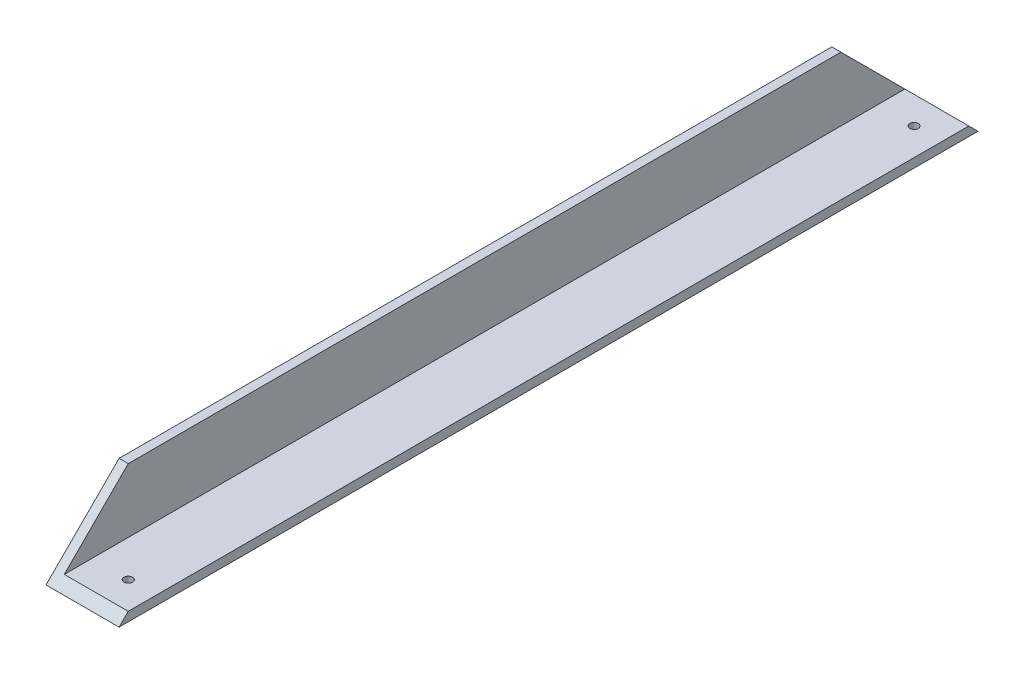
ISO-10303-21;
HEADER;
FILE_DESCRIPTION(('STEP AP214'),'2;1');
FILE_NAME('part.step','',(''),(''),'','','');
FILE_SCHEMA(('AUTOMOTIVE_DESIGN { 1 0 10303 214 1 1 1 1 }'));
ENDSEC;
DATA;
#1=APPLICATION_CONTEXT('core data for automotive mechanical design processes');
#2=APPLICATION_PROTOCOL_DEFINITION('international standard','automotive_design',2000,#1);
#3=PRODUCT_CONTEXT('',#1,'mechanical');
#4=PRODUCT('Part','Part','',(#3));
#5=PRODUCT_RELATED_PRODUCT_CATEGORY('part','',(#4));
#6=PRODUCT_DEFINITION_FORMATION('','',#4);
#7=PRODUCT_DEFINITION_CONTEXT('part definition',#1,'design');
#8=PRODUCT_DEFINITION('design','',#6,#7);
#9=PRODUCT_DEFINITION_SHAPE('','',#8);
#10=(LENGTH_UNIT() NAMED_UNIT(*) SI_UNIT(.MILLI.,.METRE.));
#11=(NAMED_UNIT(*) PLANE_ANGLE_UNIT() SI_UNIT($,.RADIAN.));
#12=(NAMED_UNIT(*) SI_UNIT($,.STERADIAN.) SOLID_ANGLE_UNIT());
#13=UNCERTAINTY_MEASURE_WITH_UNIT(LENGTH_MEASURE(1.E-05),#10,'distance_accuracy_value','');
#14=(GEOMETRIC_REPRESENTATION_CONTEXT(3) GLOBAL_UNCERTAINTY_ASSIGNED_CONTEXT((#13)) GLOBAL_UNIT_ASSIGNED_CONTEXT((#10,
#11,#12)) REPRESENTATION_CONTEXT('',''));
#15=CARTESIAN_POINT('',(0.,0.,0.));
#16=DIRECTION('',(0.,0.,1.));
#17=DIRECTION('',(1.,0.,0.));
#18=AXIS2_PLACEMENT_3D('',#15,#16,#17);
#19=CARTESIAN_POINT('',(25.4,0.,298.45));
#20=DIRECTION('',(-1.,0.,0.));
#21=DIRECTION('',(0.,0.,1.));
#22=AXIS2_PLACEMENT_3D('',#19,#20,#21);
#23=PLANE('',#22);
#24=DIRECTION('',(0.,0.707106781186544,-0.707106781186551));
#25=VECTOR('',#24,1.);
#26=CARTESIAN_POINT('',(25.4,0.,298.45));
#27=LINE('',#26,#25);
#28=CARTESIAN_POINT('',(25.4,0.,298.45));
#29=VERTEX_POINT('',#28);
#30=CARTESIAN_POINT('',(25.4,3.17500000000001,295.275));
#31=VERTEX_POINT('',#30);
#32=EDGE_CURVE('E145',#29,#31,#27,.T.);
#33=ORIENTED_EDGE('',*,*,#32,.F.);
#34=DIRECTION('',(0.,0.,-1.));
#35=VECTOR('',#34,1.);
#36=CARTESIAN_POINT('',(25.4,0.,298.45));
#37=LINE('',#36,#35);
#38=CARTESIAN_POINT('',(25.4,0.,0.));
#39=VERTEX_POINT('',#38);
#40=EDGE_CURVE('E11',#29,#39,#37,.T.);
#41=ORIENTED_EDGE('',*,*,#40,.T.);
#42=DIRECTION('',(0.,0.707106781186547,0.707106781186548));
#43=VECTOR('',#42,1.);
#44=CARTESIAN_POINT('',(25.4,149.225,149.225));
#45=LINE('',#44,#43);
#46=CARTESIAN_POINT('',(25.4,3.17500000000001,3.17500000000004));
#47=VERTEX_POINT('',#46);
#48=EDGE_CURVE('E135',#39,#47,#45,.T.);
#49=ORIENTED_EDGE('',*,*,#48,.T.);
#50=DIRECTION('',(0.,0.,-1.));
#51=VECTOR('',#50,1.);
#52=CARTESIAN_POINT('',(25.4,3.17500000000001,298.45));
#53=LINE('',#52,#51);
#54=EDGE_CURVE('E52',#31,#47,#53,.T.);
#55=ORIENTED_EDGE('',*,*,#54,.F.);
#56=EDGE_LOOP('',(#33,#41,#49,#55));
#57=FACE_BOUND('',#56,.T.);
#58=ADVANCED_FACE('F43',(#57),#23,.F.);
#59=CARTESIAN_POINT('',(25.4,3.17500000000001,298.45));
#60=DIRECTION('',(0.,-1.,0.));
#61=DIRECTION('',(1.,0.,0.));
#62=AXIS2_PLACEMENT_3D('',#59,#60,#61);
#63=PLANE('',#62);
#64=CARTESIAN_POINT('',(15.875,3.17500000000004,12.7000000000001));
#65=DIRECTION('',(0.,-1.,0.));
#66=DIRECTION('',(1.,0.,0.));
#67=AXIS2_PLACEMENT_3D('',#64,#65,#66);
#68=CIRCLE('',#67,1.5);
#69=CARTESIAN_POINT('',(17.375,3.17500000000004,12.7000000000001));
#70=VERTEX_POINT('',#69);
#71=EDGE_CURVE('E161',#70,#70,#68,.T.);
#72=ORIENTED_EDGE('',*,*,#71,.T.);
#73=EDGE_LOOP('',(#72));
#74=FACE_BOUND('',#73,.T.);
#75=CARTESIAN_POINT('',(15.875,3.17500000000004,285.75));
#76=DIRECTION('',(0.,-1.,0.));
#77=DIRECTION('',(1.,0.,0.));
#78=AXIS2_PLACEMENT_3D('',#75,#76,#77);
#79=CIRCLE('',#78,1.5);
#80=CARTESIAN_POINT('',(17.375,3.17500000000004,285.75));
#81=VERTEX_POINT('',#80);
#82=EDGE_CURVE('E106',#81,#81,#79,.T.);
#83=ORIENTED_EDGE('',*,*,#82,.T.);
#84=EDGE_LOOP('',(#83));
#85=FACE_BOUND('',#84,.T.);
#86=DIRECTION('',(-1.,0.,0.));
#87=VECTOR('',#86,1.);
#88=CARTESIAN_POINT('',(25.4,3.17500000000001,295.275));
#89=LINE('',#88,#87);
#90=CARTESIAN_POINT('',(3.175,3.175,295.275));
#91=VERTEX_POINT('',#90);
#92=EDGE_CURVE('E128',#31,#91,#89,.T.);
#93=ORIENTED_EDGE('',*,*,#92,.F.);
#94=ORIENTED_EDGE('',*,*,#54,.T.);
#95=DIRECTION('',(-1.,0.,0.));
#96=VECTOR('',#95,1.);
#97=CARTESIAN_POINT('',(25.4,3.17500000000001,3.17500000000004));
#98=LINE('',#97,#96);
#99=CARTESIAN_POINT('',(3.175,3.17500000000001,3.17499999999993));
#100=VERTEX_POINT('',#99);
#101=EDGE_CURVE('E127',#47,#100,#98,.T.);
#102=ORIENTED_EDGE('',*,*,#101,.T.);
#103=DIRECTION('',(0.,0.,-1.));
#104=VECTOR('',#103,1.);
#105=CARTESIAN_POINT('',(3.175,3.175,298.45));
#106=LINE('',#105,#104);
#107=EDGE_CURVE('E114',#91,#100,#106,.T.);
#108=ORIENTED_EDGE('',*,*,#107,.F.);
#109=EDGE_LOOP('',(#93,#94,#102,#108));
#110=FACE_BOUND('',#109,.T.);
#111=ADVANCED_FACE('F125',(#74,#85,#110),#63,.F.);
#112=CARTESIAN_POINT('',(3.175,3.175,298.45));
#113=DIRECTION('',(-1.,0.,0.));
#114=DIRECTION('',(0.,-1.,0.));
#115=AXIS2_PLACEMENT_3D('',#112,#113,#114);
#116=PLANE('',#115);
#117=DIRECTION('',(0.,0.707106781186544,-0.707106781186551));
#118=VECTOR('',#117,1.);
#119=CARTESIAN_POINT('',(3.175,1.58749999999994,296.8625));
#120=LINE('',#119,#118);
#121=CARTESIAN_POINT('',(3.17500000000004,25.4,273.05));
#122=VERTEX_POINT('',#121);
#123=EDGE_CURVE('E93',#91,#122,#120,.T.);
#124=ORIENTED_EDGE('',*,*,#123,.F.);
#125=ORIENTED_EDGE('',*,*,#107,.T.);
#126=DIRECTION('',(0.,0.707106781186547,0.707106781186548));
#127=VECTOR('',#126,1.);
#128=CARTESIAN_POINT('',(3.17499999999999,150.8125,150.8125));
#129=LINE('',#128,#127);
#130=CARTESIAN_POINT('',(3.17500000000004,25.4,25.4));
#131=VERTEX_POINT('',#130);
#132=EDGE_CURVE('E137',#100,#131,#129,.T.);
#133=ORIENTED_EDGE('',*,*,#132,.T.);
#134=DIRECTION('',(0.,0.,-1.));
#135=VECTOR('',#134,1.);
#136=CARTESIAN_POINT('',(3.175,25.4,298.45));
#137=LINE('',#136,#135);
#138=EDGE_CURVE('E112',#122,#131,#137,.T.);
#139=ORIENTED_EDGE('',*,*,#138,.F.);
#140=EDGE_LOOP('',(#124,#125,#133,#139));
#141=FACE_BOUND('',#140,.T.);
#142=ADVANCED_FACE('F153',(#141),#116,.F.);
#143=CARTESIAN_POINT('',(3.175,25.4,298.45));
#144=DIRECTION('',(0.,-1.,0.));
#145=DIRECTION('',(0.,0.,-1.));
#146=AXIS2_PLACEMENT_3D('',#143,#144,#145);
#147=PLANE('',#146);
#148=DIRECTION('',(-1.,0.,0.));
#149=VECTOR('',#148,1.);
#150=CARTESIAN_POINT('',(711.2,25.4,273.05));
#151=LINE('',#150,#149);
#152=CARTESIAN_POINT('',(0.,25.4,273.05));
#153=VERTEX_POINT('',#152);
#154=EDGE_CURVE('E90',#122,#153,#151,.T.);
#155=ORIENTED_EDGE('',*,*,#154,.F.);
#156=ORIENTED_EDGE('',*,*,#138,.T.);
#157=DIRECTION('',(-1.,0.,0.));
#158=VECTOR('',#157,1.);
#159=CARTESIAN_POINT('',(711.2,25.4,25.4));
#160=LINE('',#159,#158);
#161=CARTESIAN_POINT('',(0.,25.4,25.4));
#162=VERTEX_POINT('',#161);
#163=EDGE_CURVE('E111',#131,#162,#160,.T.);
#164=ORIENTED_EDGE('',*,*,#163,.T.);
#165=DIRECTION('',(0.,0.,-1.));
#166=VECTOR('',#165,1.);
#167=CARTESIAN_POINT('',(0.,25.4,298.45));
#168=LINE('',#167,#166);
#169=EDGE_CURVE('E101',#153,#162,#168,.T.);
#170=ORIENTED_EDGE('',*,*,#169,.F.);
#171=EDGE_LOOP('',(#155,#156,#164,#170));
#172=FACE_BOUND('',#171,.T.);
#173=ADVANCED_FACE('F109',(#172),#147,.F.);
#174=CARTESIAN_POINT('',(0.,25.4,298.45));
#175=DIRECTION('',(1.,0.,0.));
#176=DIRECTION('',(0.,0.,-1.));
#177=AXIS2_PLACEMENT_3D('',#174,#175,#176);
#178=PLANE('',#177);
#179=DIRECTION('',(0.,0.707106781186544,-0.707106781186551));
#180=VECTOR('',#179,1.);
#181=CARTESIAN_POINT('',(0.,149.225,149.224999999998));
#182=LINE('',#181,#180);
#183=CARTESIAN_POINT('',(0.,0.,298.45));
#184=VERTEX_POINT('',#183);
#185=EDGE_CURVE('E58',#184,#153,#182,.T.);
#186=ORIENTED_EDGE('',*,*,#185,.T.);
#187=ORIENTED_EDGE('',*,*,#169,.T.);
#188=DIRECTION('',(0.,0.707106781186547,0.707106781186548));
#189=VECTOR('',#188,1.);
#190=CARTESIAN_POINT('',(0.,0.,0.));
#191=LINE('',#190,#189);
#192=CARTESIAN_POINT('',(0.,0.,0.));
#193=VERTEX_POINT('',#192);
#194=EDGE_CURVE('E147',#193,#162,#191,.T.);
#195=ORIENTED_EDGE('',*,*,#194,.F.);
#196=DIRECTION('',(0.,0.,-1.));
#197=VECTOR('',#196,1.);
#198=CARTESIAN_POINT('',(0.,0.,298.45));
#199=LINE('',#198,#197);
#200=EDGE_CURVE('E104',#184,#193,#199,.T.);
#201=ORIENTED_EDGE('',*,*,#200,.F.);
#202=EDGE_LOOP('',(#186,#187,#195,#201));
#203=FACE_BOUND('',#202,.T.);
#204=ADVANCED_FACE('F99',(#203),#178,.F.);
#205=CARTESIAN_POINT('',(0.,0.,298.45));
#206=DIRECTION('',(0.,1.,0.));
#207=DIRECTION('',(0.,0.,1.));
#208=AXIS2_PLACEMENT_3D('',#205,#206,#207);
#209=PLANE('',#208);
#210=CARTESIAN_POINT('',(15.875,0.,12.7000000000001));
#211=DIRECTION('',(0.,-1.,0.));
#212=DIRECTION('',(0.,0.,-1.));
#213=AXIS2_PLACEMENT_3D('',#210,#211,#212);
#214=CIRCLE('',#213,1.5);
#215=CARTESIAN_POINT('',(15.875,0.,11.2000000000001));
#216=VERTEX_POINT('',#215);
#217=EDGE_CURVE('E164',#216,#216,#214,.T.);
#218=ORIENTED_EDGE('',*,*,#217,.F.);
#219=EDGE_LOOP('',(#218));
#220=FACE_BOUND('',#219,.T.);
#221=CARTESIAN_POINT('',(15.875,0.,285.75));
#222=DIRECTION('',(0.,-1.,0.));
#223=DIRECTION('',(0.,0.,-1.));
#224=AXIS2_PLACEMENT_3D('',#221,#222,#223);
#225=CIRCLE('',#224,1.5);
#226=CARTESIAN_POINT('',(15.875,0.,284.25));
#227=VERTEX_POINT('',#226);
#228=EDGE_CURVE('E158',#227,#227,#225,.T.);
#229=ORIENTED_EDGE('',*,*,#228,.F.);
#230=EDGE_LOOP('',(#229));
#231=FACE_BOUND('',#230,.T.);
#232=DIRECTION('',(1.,0.,0.));
#233=VECTOR('',#232,1.);
#234=CARTESIAN_POINT('',(0.,0.,0.));
#235=LINE('',#234,#233);
#236=EDGE_CURVE('E141',#193,#39,#235,.T.);
#237=ORIENTED_EDGE('',*,*,#236,.T.);
#238=ORIENTED_EDGE('',*,*,#40,.F.);
#239=DIRECTION('',(1.,0.,0.));
#240=VECTOR('',#239,1.);
#241=CARTESIAN_POINT('',(0.,0.,298.45));
#242=LINE('',#241,#240);
#243=EDGE_CURVE('E116',#184,#29,#242,.T.);
#244=ORIENTED_EDGE('',*,*,#243,.F.);
#245=ORIENTED_EDGE('',*,*,#200,.T.);
#246=EDGE_LOOP('',(#237,#238,#244,#245));
#247=FACE_BOUND('',#246,.T.);
#248=ADVANCED_FACE('F45',(#220,#231,#247),#209,.F.);
#249=CARTESIAN_POINT('',(711.2,0.,0.));
#250=DIRECTION('',(0.,-0.707106781186548,0.707106781186547));
#251=DIRECTION('',(0.,-0.707106781186547,-0.707106781186548));
#252=AXIS2_PLACEMENT_3D('',#249,#250,#251);
#253=PLANE('',#252);
#254=ORIENTED_EDGE('',*,*,#236,.F.);
#255=ORIENTED_EDGE('',*,*,#194,.T.);
#256=ORIENTED_EDGE('',*,*,#163,.F.);
#257=ORIENTED_EDGE('',*,*,#132,.F.);
#258=ORIENTED_EDGE('',*,*,#101,.F.);
#259=ORIENTED_EDGE('',*,*,#48,.F.);
#260=EDGE_LOOP('',(#254,#255,#256,#257,#258,#259));
#261=FACE_BOUND('',#260,.T.);
#262=ADVANCED_FACE('F134',(#261),#253,.F.);
#263=CARTESIAN_POINT('',(711.2,149.225,149.224999999998));
#264=DIRECTION('',(0.,0.707106781186551,0.707106781186544));
#265=DIRECTION('',(0.,-0.707106781186544,0.707106781186551));
#266=AXIS2_PLACEMENT_3D('',#263,#264,#265);
#267=PLANE('',#266);
#268=ORIENTED_EDGE('',*,*,#32,.T.);
#269=ORIENTED_EDGE('',*,*,#92,.T.);
#270=ORIENTED_EDGE('',*,*,#123,.T.);
#271=ORIENTED_EDGE('',*,*,#154,.T.);
#272=ORIENTED_EDGE('',*,*,#185,.F.);
#273=ORIENTED_EDGE('',*,*,#243,.T.);
#274=EDGE_LOOP('',(#268,#269,#270,#271,#272,#273));
#275=FACE_BOUND('',#274,.T.);
#276=ADVANCED_FACE('F91',(#275),#267,.T.);
#277=CARTESIAN_POINT('',(15.875,711.2,285.75));
#278=DIRECTION('',(0.,-1.,0.));
#279=DIRECTION('',(0.,0.,-1.));
#280=AXIS2_PLACEMENT_3D('',#277,#278,#279);
#281=CYLINDRICAL_SURFACE('',#280,1.5);
#282=ORIENTED_EDGE('',*,*,#228,.T.);
#283=EDGE_LOOP('',(#282));
#284=FACE_BOUND('',#283,.T.);
#285=ORIENTED_EDGE('',*,*,#82,.F.);
#286=EDGE_LOOP('',(#285));
#287=FACE_BOUND('',#286,.T.);
#288=ADVANCED_FACE('F175',(#284,#287),#281,.F.);
#289=CARTESIAN_POINT('',(15.875,711.2,12.7000000000001));
#290=DIRECTION('',(0.,-1.,0.));
#291=DIRECTION('',(0.,0.,-1.));
#292=AXIS2_PLACEMENT_3D('',#289,#290,#291);
#293=CYLINDRICAL_SURFACE('',#292,1.5);
#294=ORIENTED_EDGE('',*,*,#217,.T.);
#295=EDGE_LOOP('',(#294));
#296=FACE_BOUND('',#295,.T.);
#297=ORIENTED_EDGE('',*,*,#71,.F.);
#298=EDGE_LOOP('',(#297));
#299=FACE_BOUND('',#298,.T.);
#300=ADVANCED_FACE('F168',(#296,#299),#293,.F.);
#301=CLOSED_SHELL('',(#58,#111,#142,#173,#204,#248,#262,#276,#288,#300));
#302=MANIFOLD_SOLID_BREP('B2',#301);
#303=ADVANCED_BREP_SHAPE_REPRESENTATION('',(#18,#302),#14);
#304=SHAPE_DEFINITION_REPRESENTATION(#9,#303);
ENDSEC;
END-ISO-10303-21;
